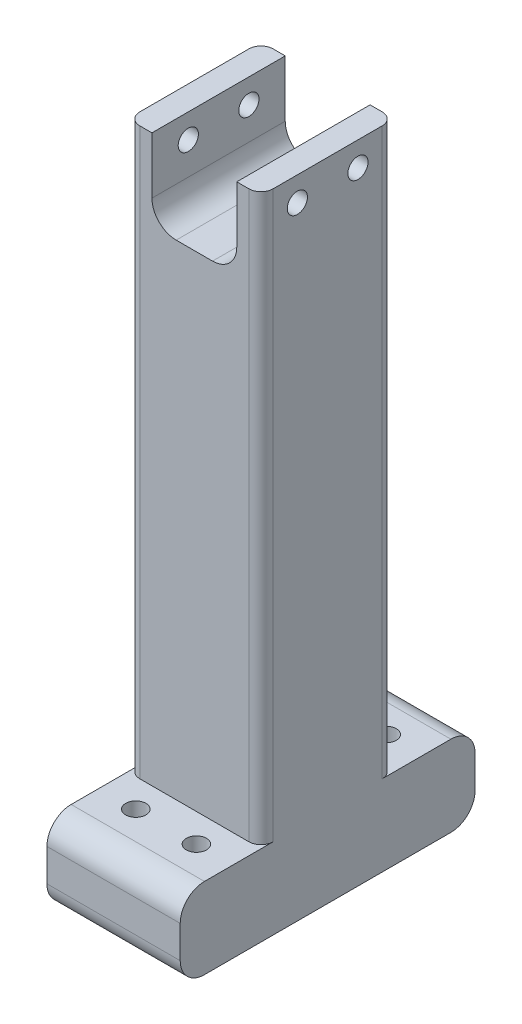
ISO-10303-21;
HEADER;
FILE_DESCRIPTION(('STEP AP214'),'2;1');
FILE_NAME('part.step','',(''),(''),'','','');
FILE_SCHEMA(('AUTOMOTIVE_DESIGN { 1 0 10303 214 1 1 1 1 }'));
ENDSEC;
DATA;
#1=APPLICATION_CONTEXT('core data for automotive mechanical design processes');
#2=APPLICATION_PROTOCOL_DEFINITION('international standard','automotive_design',2000,#1);
#3=PRODUCT_CONTEXT('',#1,'mechanical');
#4=PRODUCT('Part','Part','',(#3));
#5=PRODUCT_RELATED_PRODUCT_CATEGORY('part','',(#4));
#6=PRODUCT_DEFINITION_FORMATION('','',#4);
#7=PRODUCT_DEFINITION_CONTEXT('part definition',#1,'design');
#8=PRODUCT_DEFINITION('design','',#6,#7);
#9=PRODUCT_DEFINITION_SHAPE('','',#8);
#10=(LENGTH_UNIT() NAMED_UNIT(*) SI_UNIT(.MILLI.,.METRE.));
#11=(NAMED_UNIT(*) PLANE_ANGLE_UNIT() SI_UNIT($,.RADIAN.));
#12=(NAMED_UNIT(*) SI_UNIT($,.STERADIAN.) SOLID_ANGLE_UNIT());
#13=UNCERTAINTY_MEASURE_WITH_UNIT(LENGTH_MEASURE(1.E-05),#10,'distance_accuracy_value','');
#14=(GEOMETRIC_REPRESENTATION_CONTEXT(3) GLOBAL_UNCERTAINTY_ASSIGNED_CONTEXT((#13)) GLOBAL_UNIT_ASSIGNED_CONTEXT((#10,
#11,#12)) REPRESENTATION_CONTEXT('',''));
#15=CARTESIAN_POINT('',(0.,0.,0.));
#16=DIRECTION('',(0.,0.,1.));
#17=DIRECTION('',(1.,0.,0.));
#18=AXIS2_PLACEMENT_3D('',#15,#16,#17);
#19=CARTESIAN_POINT('',(-20.955,203.2,-20.955));
#20=DIRECTION('',(0.,0.,-1.));
#21=DIRECTION('',(-1.,0.,0.));
#22=AXIS2_PLACEMENT_3D('',#19,#20,#21);
#23=PLANE('',#22);
#24=DIRECTION('',(1.,0.,0.));
#25=VECTOR('',#24,1.);
#26=CARTESIAN_POINT('',(-20.955,203.2,-20.955));
#27=LINE('',#26,#25);
#28=CARTESIAN_POINT('',(13.335,203.2,-20.955));
#29=VERTEX_POINT('',#28);
#30=CARTESIAN_POINT('',(17.145,203.2,-20.955));
#31=VERTEX_POINT('',#30);
#32=EDGE_CURVE('E242',#29,#31,#27,.T.);
#33=ORIENTED_EDGE('',*,*,#32,.T.);
#34=DIRECTION('',(0.,-1.,0.));
#35=VECTOR('',#34,1.);
#36=CARTESIAN_POINT('',(17.145,203.2,-20.955));
#37=LINE('',#36,#35);
#38=CARTESIAN_POINT('',(17.145,25.4,-20.955));
#39=VERTEX_POINT('',#38);
#40=EDGE_CURVE('E265',#31,#39,#37,.T.);
#41=ORIENTED_EDGE('',*,*,#40,.T.);
#42=DIRECTION('',(-1.,0.,0.));
#43=VECTOR('',#42,1.);
#44=CARTESIAN_POINT('',(-20.955,25.4,-20.955));
#45=LINE('',#44,#43);
#46=CARTESIAN_POINT('',(-17.145,25.4,-20.955));
#47=VERTEX_POINT('',#46);
#48=EDGE_CURVE('E450',#39,#47,#45,.T.);
#49=ORIENTED_EDGE('',*,*,#48,.T.);
#50=DIRECTION('',(0.,-1.,0.));
#51=VECTOR('',#50,1.);
#52=CARTESIAN_POINT('',(-17.145,203.2,-20.955));
#53=LINE('',#52,#51);
#54=CARTESIAN_POINT('',(-17.145,203.2,-20.955));
#55=VERTEX_POINT('',#54);
#56=EDGE_CURVE('E251',#47,#55,#53,.F.);
#57=ORIENTED_EDGE('',*,*,#56,.T.);
#58=CARTESIAN_POINT('',(-13.335,203.2,-20.955));
#59=VERTEX_POINT('',#58);
#60=EDGE_CURVE('E239',#55,#59,#27,.T.);
#61=ORIENTED_EDGE('',*,*,#60,.T.);
#62=DIRECTION('',(0.,-1.,0.));
#63=VECTOR('',#62,1.);
#64=CARTESIAN_POINT('',(-13.335,185.42,-20.955));
#65=LINE('',#64,#63);
#66=CARTESIAN_POINT('',(-13.335,185.42,-20.955));
#67=VERTEX_POINT('',#66);
#68=EDGE_CURVE('E194',#59,#67,#65,.T.);
#69=ORIENTED_EDGE('',*,*,#68,.T.);
#70=CARTESIAN_POINT('',(-5.715,185.42,-20.955));
#71=DIRECTION('',(0.,0.,1.));
#72=DIRECTION('',(1.,0.,0.));
#73=AXIS2_PLACEMENT_3D('',#70,#71,#72);
#74=CIRCLE('',#73,7.61999999999999);
#75=CARTESIAN_POINT('',(-5.715,177.8,-20.955));
#76=VERTEX_POINT('',#75);
#77=EDGE_CURVE('E186',#67,#76,#74,.T.);
#78=ORIENTED_EDGE('',*,*,#77,.T.);
#79=DIRECTION('',(1.,0.,0.));
#80=VECTOR('',#79,1.);
#81=CARTESIAN_POINT('',(5.715,177.8,-20.955));
#82=LINE('',#81,#80);
#83=CARTESIAN_POINT('',(5.715,177.8,-20.955));
#84=VERTEX_POINT('',#83);
#85=EDGE_CURVE('E197',#76,#84,#82,.T.);
#86=ORIENTED_EDGE('',*,*,#85,.T.);
#87=CARTESIAN_POINT('',(5.715,185.42,-20.955));
#88=DIRECTION('',(0.,0.,1.));
#89=DIRECTION('',(-1.,0.,0.));
#90=AXIS2_PLACEMENT_3D('',#87,#88,#89);
#91=CIRCLE('',#90,7.61999999999999);
#92=CARTESIAN_POINT('',(13.335,185.42,-20.955));
#93=VERTEX_POINT('',#92);
#94=EDGE_CURVE('E202',#84,#93,#91,.T.);
#95=ORIENTED_EDGE('',*,*,#94,.T.);
#96=DIRECTION('',(0.,1.,0.));
#97=VECTOR('',#96,1.);
#98=CARTESIAN_POINT('',(13.335,203.2,-20.955));
#99=LINE('',#98,#97);
#100=EDGE_CURVE('E216',#93,#29,#99,.T.);
#101=ORIENTED_EDGE('',*,*,#100,.T.);
#102=EDGE_LOOP('',(#33,#41,#49,#57,#61,#69,#78,#86,#95,#101));
#103=FACE_BOUND('',#102,.T.);
#104=ADVANCED_FACE('F32',(#103),#23,.T.);
#105=CARTESIAN_POINT('',(0.,203.2,0.));
#106=DIRECTION('',(0.,-1.,0.));
#107=DIRECTION('',(0.,0.,-1.));
#108=AXIS2_PLACEMENT_3D('',#105,#106,#107);
#109=PLANE('',#108);
#110=ORIENTED_EDGE('',*,*,#60,.F.);
#111=CARTESIAN_POINT('',(-17.145,203.2,-17.145));
#112=DIRECTION('',(0.,-1.,0.));
#113=DIRECTION('',(0.,0.,-1.));
#114=AXIS2_PLACEMENT_3D('',#111,#112,#113);
#115=CIRCLE('',#114,3.81);
#116=CARTESIAN_POINT('',(-20.955,203.2,-17.145));
#117=VERTEX_POINT('',#116);
#118=EDGE_CURVE('E289',#55,#117,#115,.F.);
#119=ORIENTED_EDGE('',*,*,#118,.T.);
#120=DIRECTION('',(0.,0.,-1.));
#121=VECTOR('',#120,1.);
#122=CARTESIAN_POINT('',(-20.955,203.2,-20.955));
#123=LINE('',#122,#121);
#124=CARTESIAN_POINT('',(-20.955,203.2,17.145));
#125=VERTEX_POINT('',#124);
#126=EDGE_CURVE('E248',#125,#117,#123,.T.);
#127=ORIENTED_EDGE('',*,*,#126,.F.);
#128=CARTESIAN_POINT('',(-17.145,203.2,17.145));
#129=DIRECTION('',(0.,-1.,0.));
#130=DIRECTION('',(0.,0.,-1.));
#131=AXIS2_PLACEMENT_3D('',#128,#129,#130);
#132=CIRCLE('',#131,3.81);
#133=CARTESIAN_POINT('',(-17.145,203.2,20.955));
#134=VERTEX_POINT('',#133);
#135=EDGE_CURVE('E287',#125,#134,#132,.F.);
#136=ORIENTED_EDGE('',*,*,#135,.T.);
#137=DIRECTION('',(-1.,0.,0.));
#138=VECTOR('',#137,1.);
#139=CARTESIAN_POINT('',(-20.955,203.2,20.955));
#140=LINE('',#139,#138);
#141=CARTESIAN_POINT('',(-13.335,203.2,20.955));
#142=VERTEX_POINT('',#141);
#143=EDGE_CURVE('E245',#142,#134,#140,.T.);
#144=ORIENTED_EDGE('',*,*,#143,.F.);
#145=DIRECTION('',(0.,0.,1.));
#146=VECTOR('',#145,1.);
#147=CARTESIAN_POINT('',(-13.335,203.2,-20.955));
#148=LINE('',#147,#146);
#149=EDGE_CURVE('E231',#59,#142,#148,.T.);
#150=ORIENTED_EDGE('',*,*,#149,.F.);
#151=EDGE_LOOP('',(#110,#119,#127,#136,#144,#150));
#152=FACE_BOUND('',#151,.T.);
#153=ADVANCED_FACE('F391',(#152),#109,.F.);
#154=CARTESIAN_POINT('',(-20.955,203.2,-20.955));
#155=DIRECTION('',(-1.,0.,0.));
#156=DIRECTION('',(0.,0.,1.));
#157=AXIS2_PLACEMENT_3D('',#154,#155,#156);
#158=PLANE('',#157);
#159=CARTESIAN_POINT('',(-20.955,195.58,-9.525));
#160=DIRECTION('',(-1.,0.,0.));
#161=DIRECTION('',(0.,0.,1.));
#162=AXIS2_PLACEMENT_3D('',#159,#160,#161);
#163=CIRCLE('',#162,3.175);
#164=CARTESIAN_POINT('',(-20.955,195.58,-6.35));
#165=VERTEX_POINT('',#164);
#166=EDGE_CURVE('E359',#165,#165,#163,.T.);
#167=ORIENTED_EDGE('',*,*,#166,.F.);
#168=EDGE_LOOP('',(#167));
#169=FACE_BOUND('',#168,.T.);
#170=CARTESIAN_POINT('',(-20.955,195.58,9.525));
#171=DIRECTION('',(-1.,0.,0.));
#172=DIRECTION('',(0.,0.,1.));
#173=AXIS2_PLACEMENT_3D('',#170,#171,#172);
#174=CIRCLE('',#173,3.175);
#175=CARTESIAN_POINT('',(-20.955,195.58,12.7));
#176=VERTEX_POINT('',#175);
#177=EDGE_CURVE('E356',#176,#176,#174,.T.);
#178=ORIENTED_EDGE('',*,*,#177,.F.);
#179=EDGE_LOOP('',(#178));
#180=FACE_BOUND('',#179,.T.);
#181=DIRECTION('',(0.,0.,1.));
#182=VECTOR('',#181,1.);
#183=CARTESIAN_POINT('',(-20.955,25.4,-46.355));
#184=LINE('',#183,#182);
#185=CARTESIAN_POINT('',(-20.955,25.4,-38.735));
#186=VERTEX_POINT('',#185);
#187=CARTESIAN_POINT('',(-20.955,25.4,-17.145));
#188=VERTEX_POINT('',#187);
#189=EDGE_CURVE('E462',#186,#188,#184,.T.);
#190=ORIENTED_EDGE('',*,*,#189,.F.);
#191=CARTESIAN_POINT('',(-20.955,17.78,-38.735));
#192=DIRECTION('',(-1.,0.,0.));
#193=DIRECTION('',(0.,0.,1.));
#194=AXIS2_PLACEMENT_3D('',#191,#192,#193);
#195=CIRCLE('',#194,7.62);
#196=CARTESIAN_POINT('',(-20.955,17.78,-46.355));
#197=VERTEX_POINT('',#196);
#198=EDGE_CURVE('E310',#186,#197,#195,.T.);
#199=ORIENTED_EDGE('',*,*,#198,.T.);
#200=DIRECTION('',(0.,-1.,0.));
#201=VECTOR('',#200,1.);
#202=CARTESIAN_POINT('',(-20.955,0.,-46.355));
#203=LINE('',#202,#201);
#204=CARTESIAN_POINT('',(-20.955,7.62,-46.355));
#205=VERTEX_POINT('',#204);
#206=EDGE_CURVE('E447',#197,#205,#203,.T.);
#207=ORIENTED_EDGE('',*,*,#206,.T.);
#208=CARTESIAN_POINT('',(-20.955,7.62,-38.735));
#209=DIRECTION('',(-1.,0.,0.));
#210=DIRECTION('',(0.,0.,1.));
#211=AXIS2_PLACEMENT_3D('',#208,#209,#210);
#212=CIRCLE('',#211,7.62);
#213=CARTESIAN_POINT('',(-20.955,0.,-38.735));
#214=VERTEX_POINT('',#213);
#215=EDGE_CURVE('E308',#205,#214,#212,.T.);
#216=ORIENTED_EDGE('',*,*,#215,.T.);
#217=DIRECTION('',(0.,0.,-1.));
#218=VECTOR('',#217,1.);
#219=CARTESIAN_POINT('',(-20.955,0.,-20.955));
#220=LINE('',#219,#218);
#221=CARTESIAN_POINT('',(-20.955,0.,38.735));
#222=VERTEX_POINT('',#221);
#223=EDGE_CURVE('E253',#222,#214,#220,.T.);
#224=ORIENTED_EDGE('',*,*,#223,.F.);
#225=CARTESIAN_POINT('',(-20.955,7.62,38.735));
#226=DIRECTION('',(-1.,0.,0.));
#227=DIRECTION('',(0.,0.,1.));
#228=AXIS2_PLACEMENT_3D('',#225,#226,#227);
#229=CIRCLE('',#228,7.62);
#230=CARTESIAN_POINT('',(-20.955,7.62,46.355));
#231=VERTEX_POINT('',#230);
#232=EDGE_CURVE('E306',#222,#231,#229,.T.);
#233=ORIENTED_EDGE('',*,*,#232,.T.);
#234=DIRECTION('',(0.,-1.,0.));
#235=VECTOR('',#234,1.);
#236=CARTESIAN_POINT('',(-20.955,0.,46.355));
#237=LINE('',#236,#235);
#238=CARTESIAN_POINT('',(-20.955,17.78,46.355));
#239=VERTEX_POINT('',#238);
#240=EDGE_CURVE('E337',#239,#231,#237,.T.);
#241=ORIENTED_EDGE('',*,*,#240,.F.);
#242=CARTESIAN_POINT('',(-20.955,17.78,38.735));
#243=DIRECTION('',(-1.,0.,0.));
#244=DIRECTION('',(0.,0.,1.));
#245=AXIS2_PLACEMENT_3D('',#242,#243,#244);
#246=CIRCLE('',#245,7.62);
#247=CARTESIAN_POINT('',(-20.955,25.4,38.735));
#248=VERTEX_POINT('',#247);
#249=EDGE_CURVE('E304',#239,#248,#246,.T.);
#250=ORIENTED_EDGE('',*,*,#249,.T.);
#251=DIRECTION('',(0.,0.,-1.));
#252=VECTOR('',#251,1.);
#253=CARTESIAN_POINT('',(-20.955,25.4,46.355));
#254=LINE('',#253,#252);
#255=CARTESIAN_POINT('',(-20.955,25.4,17.145));
#256=VERTEX_POINT('',#255);
#257=EDGE_CURVE('E344',#248,#256,#254,.T.);
#258=ORIENTED_EDGE('',*,*,#257,.T.);
#259=DIRECTION('',(0.,-1.,0.));
#260=VECTOR('',#259,1.);
#261=CARTESIAN_POINT('',(-20.955,203.2,17.145));
#262=LINE('',#261,#260);
#263=EDGE_CURVE('E282',#256,#125,#262,.F.);
#264=ORIENTED_EDGE('',*,*,#263,.T.);
#265=ORIENTED_EDGE('',*,*,#126,.T.);
#266=DIRECTION('',(0.,-1.,0.));
#267=VECTOR('',#266,1.);
#268=CARTESIAN_POINT('',(-20.955,203.2,-17.145));
#269=LINE('',#268,#267);
#270=EDGE_CURVE('E284',#117,#188,#269,.T.);
#271=ORIENTED_EDGE('',*,*,#270,.T.);
#272=EDGE_LOOP('',(#190,#199,#207,#216,#224,#233,#241,#250,#258,#264,#265,#271));
#273=FACE_BOUND('',#272,.T.);
#274=ADVANCED_FACE('F396',(#169,#180,#273),#158,.T.);
#275=CARTESIAN_POINT('',(-20.955,203.2,20.955));
#276=DIRECTION('',(0.,0.,1.));
#277=DIRECTION('',(1.,0.,0.));
#278=AXIS2_PLACEMENT_3D('',#275,#276,#277);
#279=PLANE('',#278);
#280=DIRECTION('',(-1.,0.,0.));
#281=VECTOR('',#280,1.);
#282=CARTESIAN_POINT('',(-20.955,25.4,20.955));
#283=LINE('',#282,#281);
#284=CARTESIAN_POINT('',(17.145,25.4,20.955));
#285=VERTEX_POINT('',#284);
#286=CARTESIAN_POINT('',(-17.145,25.4,20.955));
#287=VERTEX_POINT('',#286);
#288=EDGE_CURVE('E348',#285,#287,#283,.T.);
#289=ORIENTED_EDGE('',*,*,#288,.F.);
#290=DIRECTION('',(0.,-1.,0.));
#291=VECTOR('',#290,1.);
#292=CARTESIAN_POINT('',(17.145,203.2,20.955));
#293=LINE('',#292,#291);
#294=CARTESIAN_POINT('',(17.145,203.2,20.955));
#295=VERTEX_POINT('',#294);
#296=EDGE_CURVE('E280',#285,#295,#293,.F.);
#297=ORIENTED_EDGE('',*,*,#296,.T.);
#298=CARTESIAN_POINT('',(13.335,203.2,20.955));
#299=VERTEX_POINT('',#298);
#300=EDGE_CURVE('E246',#295,#299,#140,.T.);
#301=ORIENTED_EDGE('',*,*,#300,.T.);
#302=DIRECTION('',(0.,1.,0.));
#303=VECTOR('',#302,1.);
#304=CARTESIAN_POINT('',(13.335,203.2,20.955));
#305=LINE('',#304,#303);
#306=CARTESIAN_POINT('',(13.335,185.42,20.955));
#307=VERTEX_POINT('',#306);
#308=EDGE_CURVE('E209',#307,#299,#305,.T.);
#309=ORIENTED_EDGE('',*,*,#308,.F.);
#310=CARTESIAN_POINT('',(5.715,185.42,20.955));
#311=DIRECTION('',(0.,0.,1.));
#312=DIRECTION('',(-1.,0.,0.));
#313=AXIS2_PLACEMENT_3D('',#310,#311,#312);
#314=CIRCLE('',#313,7.61999999999999);
#315=CARTESIAN_POINT('',(5.715,177.8,20.955));
#316=VERTEX_POINT('',#315);
#317=EDGE_CURVE('E223',#316,#307,#314,.T.);
#318=ORIENTED_EDGE('',*,*,#317,.F.);
#319=DIRECTION('',(1.,0.,0.));
#320=VECTOR('',#319,1.);
#321=CARTESIAN_POINT('',(5.715,177.8,20.955));
#322=LINE('',#321,#320);
#323=CARTESIAN_POINT('',(-5.715,177.8,20.955));
#324=VERTEX_POINT('',#323);
#325=EDGE_CURVE('E221',#324,#316,#322,.T.);
#326=ORIENTED_EDGE('',*,*,#325,.F.);
#327=CARTESIAN_POINT('',(-5.715,185.42,20.955));
#328=DIRECTION('',(0.,0.,1.));
#329=DIRECTION('',(1.,0.,0.));
#330=AXIS2_PLACEMENT_3D('',#327,#328,#329);
#331=CIRCLE('',#330,7.61999999999999);
#332=CARTESIAN_POINT('',(-13.335,185.42,20.955));
#333=VERTEX_POINT('',#332);
#334=EDGE_CURVE('E189',#333,#324,#331,.T.);
#335=ORIENTED_EDGE('',*,*,#334,.F.);
#336=DIRECTION('',(0.,-1.,0.));
#337=VECTOR('',#336,1.);
#338=CARTESIAN_POINT('',(-13.335,185.42,20.955));
#339=LINE('',#338,#337);
#340=EDGE_CURVE('E206',#142,#333,#339,.T.);
#341=ORIENTED_EDGE('',*,*,#340,.F.);
#342=ORIENTED_EDGE('',*,*,#143,.T.);
#343=DIRECTION('',(0.,-1.,0.));
#344=VECTOR('',#343,1.);
#345=CARTESIAN_POINT('',(-17.145,203.2,20.955));
#346=LINE('',#345,#344);
#347=EDGE_CURVE('E277',#134,#287,#346,.T.);
#348=ORIENTED_EDGE('',*,*,#347,.T.);
#349=EDGE_LOOP('',(#289,#297,#301,#309,#318,#326,#335,#341,#342,#348));
#350=FACE_BOUND('',#349,.T.);
#351=ADVANCED_FACE('F494',(#350),#279,.T.);
#352=CARTESIAN_POINT('',(20.955,203.2,-20.955));
#353=DIRECTION('',(1.,0.,0.));
#354=DIRECTION('',(0.,0.,-1.));
#355=AXIS2_PLACEMENT_3D('',#352,#353,#354);
#356=PLANE('',#355);
#357=CARTESIAN_POINT('',(20.955,195.58,-9.525));
#358=DIRECTION('',(-1.,0.,0.));
#359=DIRECTION('',(0.,0.,1.));
#360=AXIS2_PLACEMENT_3D('',#357,#358,#359);
#361=CIRCLE('',#360,3.175);
#362=CARTESIAN_POINT('',(20.955,195.58,-6.35));
#363=VERTEX_POINT('',#362);
#364=EDGE_CURVE('E260',#363,#363,#361,.T.);
#365=ORIENTED_EDGE('',*,*,#364,.T.);
#366=EDGE_LOOP('',(#365));
#367=FACE_BOUND('',#366,.T.);
#368=CARTESIAN_POINT('',(20.955,195.58,9.525));
#369=DIRECTION('',(-1.,0.,0.));
#370=DIRECTION('',(0.,0.,1.));
#371=AXIS2_PLACEMENT_3D('',#368,#369,#370);
#372=CIRCLE('',#371,3.175);
#373=CARTESIAN_POINT('',(20.955,195.58,12.7));
#374=VERTEX_POINT('',#373);
#375=EDGE_CURVE('E362',#374,#374,#372,.T.);
#376=ORIENTED_EDGE('',*,*,#375,.T.);
#377=EDGE_LOOP('',(#376));
#378=FACE_BOUND('',#377,.T.);
#379=DIRECTION('',(0.,1.,0.));
#380=VECTOR('',#379,1.);
#381=CARTESIAN_POINT('',(20.955,0.,-46.355));
#382=LINE('',#381,#380);
#383=CARTESIAN_POINT('',(20.955,7.62,-46.355));
#384=VERTEX_POINT('',#383);
#385=CARTESIAN_POINT('',(20.955,17.78,-46.355));
#386=VERTEX_POINT('',#385);
#387=EDGE_CURVE('E449',#384,#386,#382,.T.);
#388=ORIENTED_EDGE('',*,*,#387,.T.);
#389=CARTESIAN_POINT('',(20.955,17.78,-38.735));
#390=DIRECTION('',(1.,0.,0.));
#391=DIRECTION('',(0.,0.,-1.));
#392=AXIS2_PLACEMENT_3D('',#389,#390,#391);
#393=CIRCLE('',#392,7.62);
#394=CARTESIAN_POINT('',(20.955,25.4,-38.735));
#395=VERTEX_POINT('',#394);
#396=EDGE_CURVE('E320',#386,#395,#393,.T.);
#397=ORIENTED_EDGE('',*,*,#396,.T.);
#398=DIRECTION('',(0.,0.,1.));
#399=VECTOR('',#398,1.);
#400=CARTESIAN_POINT('',(20.955,25.4,-46.355));
#401=LINE('',#400,#399);
#402=CARTESIAN_POINT('',(20.955,25.4,-17.145));
#403=VERTEX_POINT('',#402);
#404=EDGE_CURVE('E452',#395,#403,#401,.T.);
#405=ORIENTED_EDGE('',*,*,#404,.T.);
#406=DIRECTION('',(0.,-1.,0.));
#407=VECTOR('',#406,1.);
#408=CARTESIAN_POINT('',(20.955,203.2,-17.145));
#409=LINE('',#408,#407);
#410=CARTESIAN_POINT('',(20.955,203.2,-17.145));
#411=VERTEX_POINT('',#410);
#412=EDGE_CURVE('E271',#403,#411,#409,.F.);
#413=ORIENTED_EDGE('',*,*,#412,.T.);
#414=DIRECTION('',(0.,0.,1.));
#415=VECTOR('',#414,1.);
#416=CARTESIAN_POINT('',(20.955,203.2,-20.955));
#417=LINE('',#416,#415);
#418=CARTESIAN_POINT('',(20.955,203.2,17.145));
#419=VERTEX_POINT('',#418);
#420=EDGE_CURVE('E241',#411,#419,#417,.T.);
#421=ORIENTED_EDGE('',*,*,#420,.T.);
#422=DIRECTION('',(0.,-1.,0.));
#423=VECTOR('',#422,1.);
#424=CARTESIAN_POINT('',(20.955,203.2,17.145));
#425=LINE('',#424,#423);
#426=CARTESIAN_POINT('',(20.955,25.4,17.145));
#427=VERTEX_POINT('',#426);
#428=EDGE_CURVE('E268',#419,#427,#425,.T.);
#429=ORIENTED_EDGE('',*,*,#428,.T.);
#430=DIRECTION('',(0.,0.,-1.));
#431=VECTOR('',#430,1.);
#432=CARTESIAN_POINT('',(20.955,25.4,46.355));
#433=LINE('',#432,#431);
#434=CARTESIAN_POINT('',(20.955,25.4,38.735));
#435=VERTEX_POINT('',#434);
#436=EDGE_CURVE('E346',#435,#427,#433,.T.);
#437=ORIENTED_EDGE('',*,*,#436,.F.);
#438=CARTESIAN_POINT('',(20.955,17.78,38.735));
#439=DIRECTION('',(1.,0.,0.));
#440=DIRECTION('',(0.,0.,-1.));
#441=AXIS2_PLACEMENT_3D('',#438,#439,#440);
#442=CIRCLE('',#441,7.62);
#443=CARTESIAN_POINT('',(20.955,17.78,46.355));
#444=VERTEX_POINT('',#443);
#445=EDGE_CURVE('E316',#435,#444,#442,.T.);
#446=ORIENTED_EDGE('',*,*,#445,.T.);
#447=DIRECTION('',(0.,1.,0.));
#448=VECTOR('',#447,1.);
#449=CARTESIAN_POINT('',(20.955,0.,46.355));
#450=LINE('',#449,#448);
#451=CARTESIAN_POINT('',(20.955,7.62,46.355));
#452=VERTEX_POINT('',#451);
#453=EDGE_CURVE('E334',#452,#444,#450,.T.);
#454=ORIENTED_EDGE('',*,*,#453,.F.);
#455=CARTESIAN_POINT('',(20.955,7.62,38.735));
#456=DIRECTION('',(1.,0.,0.));
#457=DIRECTION('',(0.,0.,-1.));
#458=AXIS2_PLACEMENT_3D('',#455,#456,#457);
#459=CIRCLE('',#458,7.62);
#460=CARTESIAN_POINT('',(20.955,0.,38.735));
#461=VERTEX_POINT('',#460);
#462=EDGE_CURVE('E47',#452,#461,#459,.T.);
#463=ORIENTED_EDGE('',*,*,#462,.T.);
#464=DIRECTION('',(0.,0.,1.));
#465=VECTOR('',#464,1.);
#466=CARTESIAN_POINT('',(20.955,0.,-20.955));
#467=LINE('',#466,#465);
#468=CARTESIAN_POINT('',(20.955,0.,-38.735));
#469=VERTEX_POINT('',#468);
#470=EDGE_CURVE('E230',#469,#461,#467,.T.);
#471=ORIENTED_EDGE('',*,*,#470,.F.);
#472=CARTESIAN_POINT('',(20.955,7.62,-38.735));
#473=DIRECTION('',(1.,0.,0.));
#474=DIRECTION('',(0.,0.,-1.));
#475=AXIS2_PLACEMENT_3D('',#472,#473,#474);
#476=CIRCLE('',#475,7.62);
#477=EDGE_CURVE('E55',#469,#384,#476,.T.);
#478=ORIENTED_EDGE('',*,*,#477,.T.);
#479=EDGE_LOOP('',(#388,#397,#405,#413,#421,#429,#437,#446,#454,#463,#471,#478));
#480=FACE_BOUND('',#479,.T.);
#481=ADVANCED_FACE('F341',(#367,#378,#480),#356,.T.);
#482=ORIENTED_EDGE('',*,*,#420,.F.);
#483=CARTESIAN_POINT('',(17.145,203.2,-17.145));
#484=DIRECTION('',(0.,-1.,0.));
#485=DIRECTION('',(0.,0.,-1.));
#486=AXIS2_PLACEMENT_3D('',#483,#484,#485);
#487=CIRCLE('',#486,3.81);
#488=EDGE_CURVE('E275',#411,#31,#487,.F.);
#489=ORIENTED_EDGE('',*,*,#488,.T.);
#490=ORIENTED_EDGE('',*,*,#32,.F.);
#491=DIRECTION('',(0.,0.,1.));
#492=VECTOR('',#491,1.);
#493=CARTESIAN_POINT('',(13.335,203.2,-20.955));
#494=LINE('',#493,#492);
#495=EDGE_CURVE('E233',#29,#299,#494,.T.);
#496=ORIENTED_EDGE('',*,*,#495,.T.);
#497=ORIENTED_EDGE('',*,*,#300,.F.);
#498=CARTESIAN_POINT('',(17.145,203.2,17.145));
#499=DIRECTION('',(0.,-1.,0.));
#500=DIRECTION('',(0.,0.,-1.));
#501=AXIS2_PLACEMENT_3D('',#498,#499,#500);
#502=CIRCLE('',#501,3.81);
#503=EDGE_CURVE('E273',#295,#419,#502,.F.);
#504=ORIENTED_EDGE('',*,*,#503,.T.);
#505=EDGE_LOOP('',(#482,#489,#490,#496,#497,#504));
#506=FACE_BOUND('',#505,.T.);
#507=ADVANCED_FACE('F399',(#506),#109,.F.);
#508=CARTESIAN_POINT('',(0.,0.,0.));
#509=DIRECTION('',(0.,-1.,0.));
#510=DIRECTION('',(0.,0.,-1.));
#511=AXIS2_PLACEMENT_3D('',#508,#509,#510);
#512=PLANE('',#511);
#513=CARTESIAN_POINT('',(-9.525,0.,-29.845));
#514=DIRECTION('',(0.,-1.,0.));
#515=DIRECTION('',(-1.,0.,0.));
#516=AXIS2_PLACEMENT_3D('',#513,#514,#515);
#517=CIRCLE('',#516,3.175);
#518=CARTESIAN_POINT('',(-12.7,0.,-29.845));
#519=VERTEX_POINT('',#518);
#520=EDGE_CURVE('E455',#519,#519,#517,.T.);
#521=ORIENTED_EDGE('',*,*,#520,.F.);
#522=EDGE_LOOP('',(#521));
#523=FACE_BOUND('',#522,.T.);
#524=CARTESIAN_POINT('',(9.525,0.,-29.845));
#525=DIRECTION('',(0.,-1.,0.));
#526=DIRECTION('',(-1.,0.,0.));
#527=AXIS2_PLACEMENT_3D('',#524,#525,#526);
#528=CIRCLE('',#527,3.175);
#529=CARTESIAN_POINT('',(6.35,0.,-29.845));
#530=VERTEX_POINT('',#529);
#531=EDGE_CURVE('E772',#530,#530,#528,.T.);
#532=ORIENTED_EDGE('',*,*,#531,.F.);
#533=EDGE_LOOP('',(#532));
#534=FACE_BOUND('',#533,.T.);
#535=CARTESIAN_POINT('',(-9.525,0.,29.845));
#536=DIRECTION('',(0.,1.,0.));
#537=DIRECTION('',(-1.,0.,0.));
#538=AXIS2_PLACEMENT_3D('',#535,#536,#537);
#539=CIRCLE('',#538,3.175);
#540=CARTESIAN_POINT('',(-12.7,0.,29.845));
#541=VERTEX_POINT('',#540);
#542=EDGE_CURVE('E353',#541,#541,#539,.T.);
#543=ORIENTED_EDGE('',*,*,#542,.T.);
#544=EDGE_LOOP('',(#543));
#545=FACE_BOUND('',#544,.T.);
#546=CARTESIAN_POINT('',(9.525,0.,29.845));
#547=DIRECTION('',(0.,1.,0.));
#548=DIRECTION('',(-1.,0.,0.));
#549=AXIS2_PLACEMENT_3D('',#546,#547,#548);
#550=CIRCLE('',#549,3.175);
#551=CARTESIAN_POINT('',(6.35,0.,29.845));
#552=VERTEX_POINT('',#551);
#553=EDGE_CURVE('E470',#552,#552,#550,.T.);
#554=ORIENTED_EDGE('',*,*,#553,.T.);
#555=EDGE_LOOP('',(#554));
#556=FACE_BOUND('',#555,.T.);
#557=ORIENTED_EDGE('',*,*,#223,.T.);
#558=DIRECTION('',(1.,0.,0.));
#559=VECTOR('',#558,1.);
#560=CARTESIAN_POINT('',(20.955,0.,-38.735));
#561=LINE('',#560,#559);
#562=EDGE_CURVE('E324',#214,#469,#561,.T.);
#563=ORIENTED_EDGE('',*,*,#562,.T.);
#564=ORIENTED_EDGE('',*,*,#470,.T.);
#565=DIRECTION('',(1.,0.,0.));
#566=VECTOR('',#565,1.);
#567=CARTESIAN_POINT('',(-20.955,0.,38.735));
#568=LINE('',#567,#566);
#569=EDGE_CURVE('E322',#461,#222,#568,.F.);
#570=ORIENTED_EDGE('',*,*,#569,.T.);
#571=EDGE_LOOP('',(#557,#563,#564,#570));
#572=FACE_BOUND('',#571,.T.);
#573=ADVANCED_FACE('F403',(#523,#534,#545,#556,#572),#512,.T.);
#574=CARTESIAN_POINT('',(-5.715,185.42,-20.955));
#575=DIRECTION('',(0.,0.,1.));
#576=DIRECTION('',(1.,0.,0.));
#577=AXIS2_PLACEMENT_3D('',#574,#575,#576);
#578=CYLINDRICAL_SURFACE('',#577,7.61999999999999);
#579=ORIENTED_EDGE('',*,*,#334,.T.);
#580=DIRECTION('',(0.,0.,1.));
#581=VECTOR('',#580,1.);
#582=CARTESIAN_POINT('',(-5.715,177.8,-20.955));
#583=LINE('',#582,#581);
#584=EDGE_CURVE('E182',#76,#324,#583,.T.);
#585=ORIENTED_EDGE('',*,*,#584,.F.);
#586=ORIENTED_EDGE('',*,*,#77,.F.);
#587=DIRECTION('',(0.,0.,1.));
#588=VECTOR('',#587,1.);
#589=CARTESIAN_POINT('',(-13.335,185.42,-20.955));
#590=LINE('',#589,#588);
#591=EDGE_CURVE('E228',#67,#333,#590,.T.);
#592=ORIENTED_EDGE('',*,*,#591,.T.);
#593=EDGE_LOOP('',(#579,#585,#586,#592));
#594=FACE_BOUND('',#593,.T.);
#595=ADVANCED_FACE('F184',(#594),#578,.F.);
#596=CARTESIAN_POINT('',(-13.335,185.42,-20.955));
#597=DIRECTION('',(-1.,0.,0.));
#598=DIRECTION('',(0.,0.,1.));
#599=AXIS2_PLACEMENT_3D('',#596,#597,#598);
#600=PLANE('',#599);
#601=CARTESIAN_POINT('',(-13.335,195.58,-9.525));
#602=DIRECTION('',(-1.,0.,0.));
#603=DIRECTION('',(0.,0.,1.));
#604=AXIS2_PLACEMENT_3D('',#601,#602,#603);
#605=CIRCLE('',#604,3.175);
#606=CARTESIAN_POINT('',(-13.335,195.58,-6.35));
#607=VERTEX_POINT('',#606);
#608=EDGE_CURVE('E212',#607,#607,#605,.T.);
#609=ORIENTED_EDGE('',*,*,#608,.T.);
#610=EDGE_LOOP('',(#609));
#611=FACE_BOUND('',#610,.T.);
#612=CARTESIAN_POINT('',(-13.335,195.58,9.525));
#613=DIRECTION('',(-1.,0.,0.));
#614=DIRECTION('',(0.,0.,1.));
#615=AXIS2_PLACEMENT_3D('',#612,#613,#614);
#616=CIRCLE('',#615,3.175);
#617=CARTESIAN_POINT('',(-13.335,195.58,12.7));
#618=VERTEX_POINT('',#617);
#619=EDGE_CURVE('E259',#618,#618,#616,.T.);
#620=ORIENTED_EDGE('',*,*,#619,.T.);
#621=EDGE_LOOP('',(#620));
#622=FACE_BOUND('',#621,.T.);
#623=ORIENTED_EDGE('',*,*,#340,.T.);
#624=ORIENTED_EDGE('',*,*,#591,.F.);
#625=ORIENTED_EDGE('',*,*,#68,.F.);
#626=ORIENTED_EDGE('',*,*,#149,.T.);
#627=EDGE_LOOP('',(#623,#624,#625,#626));
#628=FACE_BOUND('',#627,.T.);
#629=ADVANCED_FACE('F369',(#611,#622,#628),#600,.F.);
#630=CARTESIAN_POINT('',(13.335,203.2,-20.955));
#631=DIRECTION('',(1.,0.,0.));
#632=DIRECTION('',(0.,0.,-1.));
#633=AXIS2_PLACEMENT_3D('',#630,#631,#632);
#634=PLANE('',#633);
#635=CARTESIAN_POINT('',(13.335,195.58,-9.525));
#636=DIRECTION('',(1.,0.,0.));
#637=DIRECTION('',(0.,0.,-1.));
#638=AXIS2_PLACEMENT_3D('',#635,#636,#637);
#639=CIRCLE('',#638,3.175);
#640=CARTESIAN_POINT('',(13.335,195.58,-12.7));
#641=VERTEX_POINT('',#640);
#642=EDGE_CURVE('E261',#641,#641,#639,.T.);
#643=ORIENTED_EDGE('',*,*,#642,.T.);
#644=EDGE_LOOP('',(#643));
#645=FACE_BOUND('',#644,.T.);
#646=CARTESIAN_POINT('',(13.335,195.58,9.525));
#647=DIRECTION('',(1.,0.,0.));
#648=DIRECTION('',(0.,0.,-1.));
#649=AXIS2_PLACEMENT_3D('',#646,#647,#648);
#650=CIRCLE('',#649,3.175);
#651=CARTESIAN_POINT('',(13.335,195.58,6.35));
#652=VERTEX_POINT('',#651);
#653=EDGE_CURVE('E256',#652,#652,#650,.T.);
#654=ORIENTED_EDGE('',*,*,#653,.T.);
#655=EDGE_LOOP('',(#654));
#656=FACE_BOUND('',#655,.T.);
#657=ORIENTED_EDGE('',*,*,#308,.T.);
#658=ORIENTED_EDGE('',*,*,#495,.F.);
#659=ORIENTED_EDGE('',*,*,#100,.F.);
#660=DIRECTION('',(0.,0.,1.));
#661=VECTOR('',#660,1.);
#662=CARTESIAN_POINT('',(13.335,185.42,-20.955));
#663=LINE('',#662,#661);
#664=EDGE_CURVE('E236',#93,#307,#663,.T.);
#665=ORIENTED_EDGE('',*,*,#664,.T.);
#666=EDGE_LOOP('',(#657,#658,#659,#665));
#667=FACE_BOUND('',#666,.T.);
#668=ADVANCED_FACE('F520',(#645,#656,#667),#634,.F.);
#669=CARTESIAN_POINT('',(5.715,185.42,-20.955));
#670=DIRECTION('',(0.,0.,1.));
#671=DIRECTION('',(1.,0.,0.));
#672=AXIS2_PLACEMENT_3D('',#669,#670,#671);
#673=CYLINDRICAL_SURFACE('',#672,7.61999999999999);
#674=ORIENTED_EDGE('',*,*,#317,.T.);
#675=ORIENTED_EDGE('',*,*,#664,.F.);
#676=ORIENTED_EDGE('',*,*,#94,.F.);
#677=DIRECTION('',(0.,0.,1.));
#678=VECTOR('',#677,1.);
#679=CARTESIAN_POINT('',(5.715,177.8,-20.955));
#680=LINE('',#679,#678);
#681=EDGE_CURVE('E193',#84,#316,#680,.T.);
#682=ORIENTED_EDGE('',*,*,#681,.T.);
#683=EDGE_LOOP('',(#674,#675,#676,#682));
#684=FACE_BOUND('',#683,.T.);
#685=ADVANCED_FACE('F517',(#684),#673,.F.);
#686=CARTESIAN_POINT('',(5.715,177.8,-20.955));
#687=DIRECTION('',(0.,-1.,0.));
#688=DIRECTION('',(0.,0.,-1.));
#689=AXIS2_PLACEMENT_3D('',#686,#687,#688);
#690=PLANE('',#689);
#691=ORIENTED_EDGE('',*,*,#325,.T.);
#692=ORIENTED_EDGE('',*,*,#681,.F.);
#693=ORIENTED_EDGE('',*,*,#85,.F.);
#694=ORIENTED_EDGE('',*,*,#584,.T.);
#695=EDGE_LOOP('',(#691,#692,#693,#694));
#696=FACE_BOUND('',#695,.T.);
#697=ADVANCED_FACE('F198',(#696),#690,.F.);
#698=CARTESIAN_POINT('',(20.955,195.58,9.525));
#699=DIRECTION('',(-1.,0.,0.));
#700=DIRECTION('',(0.,0.,1.));
#701=AXIS2_PLACEMENT_3D('',#698,#699,#700);
#702=CYLINDRICAL_SURFACE('',#701,3.175);
#703=ORIENTED_EDGE('',*,*,#375,.F.);
#704=EDGE_LOOP('',(#703));
#705=FACE_BOUND('',#704,.T.);
#706=ORIENTED_EDGE('',*,*,#653,.F.);
#707=EDGE_LOOP('',(#706));
#708=FACE_BOUND('',#707,.T.);
#709=ADVANCED_FACE('F378',(#705,#708),#702,.F.);
#710=CARTESIAN_POINT('',(20.955,195.58,-9.525));
#711=DIRECTION('',(-1.,0.,0.));
#712=DIRECTION('',(0.,0.,1.));
#713=AXIS2_PLACEMENT_3D('',#710,#711,#712);
#714=CYLINDRICAL_SURFACE('',#713,3.175);
#715=ORIENTED_EDGE('',*,*,#364,.F.);
#716=EDGE_LOOP('',(#715));
#717=FACE_BOUND('',#716,.T.);
#718=ORIENTED_EDGE('',*,*,#642,.F.);
#719=EDGE_LOOP('',(#718));
#720=FACE_BOUND('',#719,.T.);
#721=ADVANCED_FACE('F375',(#717,#720),#714,.F.);
#722=ORIENTED_EDGE('',*,*,#177,.T.);
#723=EDGE_LOOP('',(#722));
#724=FACE_BOUND('',#723,.T.);
#725=ORIENTED_EDGE('',*,*,#619,.F.);
#726=EDGE_LOOP('',(#725));
#727=FACE_BOUND('',#726,.T.);
#728=ADVANCED_FACE('F372',(#724,#727),#702,.F.);
#729=ORIENTED_EDGE('',*,*,#166,.T.);
#730=EDGE_LOOP('',(#729));
#731=FACE_BOUND('',#730,.T.);
#732=ORIENTED_EDGE('',*,*,#608,.F.);
#733=EDGE_LOOP('',(#732));
#734=FACE_BOUND('',#733,.T.);
#735=ADVANCED_FACE('F374',(#731,#734),#714,.F.);
#736=CARTESIAN_POINT('',(-20.955,25.4,46.355));
#737=DIRECTION('',(0.,-1.,0.));
#738=DIRECTION('',(1.,0.,0.));
#739=AXIS2_PLACEMENT_3D('',#736,#737,#738);
#740=PLANE('',#739);
#741=CARTESIAN_POINT('',(-9.525,25.4,29.845));
#742=DIRECTION('',(0.,1.,0.));
#743=DIRECTION('',(-1.,0.,0.));
#744=AXIS2_PLACEMENT_3D('',#741,#742,#743);
#745=CIRCLE('',#744,3.175);
#746=CARTESIAN_POINT('',(-12.7,25.4,29.845));
#747=VERTEX_POINT('',#746);
#748=EDGE_CURVE('E467',#747,#747,#745,.T.);
#749=ORIENTED_EDGE('',*,*,#748,.F.);
#750=EDGE_LOOP('',(#749));
#751=FACE_BOUND('',#750,.T.);
#752=CARTESIAN_POINT('',(9.525,25.4,29.845));
#753=DIRECTION('',(0.,1.,0.));
#754=DIRECTION('',(-1.,0.,0.));
#755=AXIS2_PLACEMENT_3D('',#752,#753,#754);
#756=CIRCLE('',#755,3.175);
#757=CARTESIAN_POINT('',(6.35,25.4,29.845));
#758=VERTEX_POINT('',#757);
#759=EDGE_CURVE('E464',#758,#758,#756,.T.);
#760=ORIENTED_EDGE('',*,*,#759,.F.);
#761=EDGE_LOOP('',(#760));
#762=FACE_BOUND('',#761,.T.);
#763=ORIENTED_EDGE('',*,*,#257,.F.);
#764=DIRECTION('',(-1.,0.,0.));
#765=VECTOR('',#764,1.);
#766=CARTESIAN_POINT('',(-20.955,25.4,38.735));
#767=LINE('',#766,#765);
#768=EDGE_CURVE('E11',#248,#435,#767,.F.);
#769=ORIENTED_EDGE('',*,*,#768,.T.);
#770=ORIENTED_EDGE('',*,*,#436,.T.);
#771=CARTESIAN_POINT('',(17.145,25.4,17.145));
#772=DIRECTION('',(0.,-1.,0.));
#773=DIRECTION('',(1.,0.,0.));
#774=AXIS2_PLACEMENT_3D('',#771,#772,#773);
#775=CIRCLE('',#774,3.81);
#776=EDGE_CURVE('E294',#427,#285,#775,.T.);
#777=ORIENTED_EDGE('',*,*,#776,.T.);
#778=ORIENTED_EDGE('',*,*,#288,.T.);
#779=CARTESIAN_POINT('',(-17.145,25.4,17.145));
#780=DIRECTION('',(0.,-1.,0.));
#781=DIRECTION('',(1.,0.,0.));
#782=AXIS2_PLACEMENT_3D('',#779,#780,#781);
#783=CIRCLE('',#782,3.81);
#784=EDGE_CURVE('E298',#287,#256,#783,.T.);
#785=ORIENTED_EDGE('',*,*,#784,.T.);
#786=EDGE_LOOP('',(#763,#769,#770,#777,#778,#785));
#787=FACE_BOUND('',#786,.T.);
#788=ADVANCED_FACE('F383',(#751,#762,#787),#740,.F.);
#789=CARTESIAN_POINT('',(0.,0.,46.355));
#790=DIRECTION('',(0.,0.,-1.));
#791=DIRECTION('',(-1.,0.,0.));
#792=AXIS2_PLACEMENT_3D('',#789,#790,#791);
#793=PLANE('',#792);
#794=ORIENTED_EDGE('',*,*,#240,.T.);
#795=DIRECTION('',(1.,0.,0.));
#796=VECTOR('',#795,1.);
#797=CARTESIAN_POINT('',(20.955,7.62,46.355));
#798=LINE('',#797,#796);
#799=EDGE_CURVE('E40',#231,#452,#798,.T.);
#800=ORIENTED_EDGE('',*,*,#799,.T.);
#801=ORIENTED_EDGE('',*,*,#453,.T.);
#802=DIRECTION('',(-1.,0.,0.));
#803=VECTOR('',#802,1.);
#804=CARTESIAN_POINT('',(0.,17.78,46.355));
#805=LINE('',#804,#803);
#806=EDGE_CURVE('E326',#444,#239,#805,.T.);
#807=ORIENTED_EDGE('',*,*,#806,.T.);
#808=EDGE_LOOP('',(#794,#800,#801,#807));
#809=FACE_BOUND('',#808,.T.);
#810=ADVANCED_FACE('F333',(#809),#793,.F.);
#811=CARTESIAN_POINT('',(9.525,0.,29.845));
#812=DIRECTION('',(0.,1.,0.));
#813=DIRECTION('',(-1.,0.,0.));
#814=AXIS2_PLACEMENT_3D('',#811,#812,#813);
#815=CYLINDRICAL_SURFACE('',#814,3.175);
#816=ORIENTED_EDGE('',*,*,#553,.F.);
#817=EDGE_LOOP('',(#816));
#818=FACE_BOUND('',#817,.T.);
#819=ORIENTED_EDGE('',*,*,#759,.T.);
#820=EDGE_LOOP('',(#819));
#821=FACE_BOUND('',#820,.T.);
#822=ADVANCED_FACE('F475',(#818,#821),#815,.F.);
#823=CARTESIAN_POINT('',(-9.525,0.,29.845));
#824=DIRECTION('',(0.,1.,0.));
#825=DIRECTION('',(-1.,0.,0.));
#826=AXIS2_PLACEMENT_3D('',#823,#824,#825);
#827=CYLINDRICAL_SURFACE('',#826,3.175);
#828=ORIENTED_EDGE('',*,*,#542,.F.);
#829=EDGE_LOOP('',(#828));
#830=FACE_BOUND('',#829,.T.);
#831=ORIENTED_EDGE('',*,*,#748,.T.);
#832=EDGE_LOOP('',(#831));
#833=FACE_BOUND('',#832,.T.);
#834=ADVANCED_FACE('F613',(#830,#833),#827,.F.);
#835=CARTESIAN_POINT('',(-20.955,25.4,-46.355));
#836=DIRECTION('',(0.,1.,0.));
#837=DIRECTION('',(-1.,0.,0.));
#838=AXIS2_PLACEMENT_3D('',#835,#836,#837);
#839=PLANE('',#838);
#840=CARTESIAN_POINT('',(-9.525,25.4,-29.845));
#841=DIRECTION('',(0.,-1.,0.));
#842=DIRECTION('',(-1.,0.,0.));
#843=AXIS2_PLACEMENT_3D('',#840,#841,#842);
#844=CIRCLE('',#843,3.175);
#845=CARTESIAN_POINT('',(-12.7,25.4,-29.845));
#846=VERTEX_POINT('',#845);
#847=EDGE_CURVE('E768',#846,#846,#844,.T.);
#848=ORIENTED_EDGE('',*,*,#847,.T.);
#849=EDGE_LOOP('',(#848));
#850=FACE_BOUND('',#849,.T.);
#851=CARTESIAN_POINT('',(9.525,25.4,-29.845));
#852=DIRECTION('',(0.,-1.,0.));
#853=DIRECTION('',(-1.,0.,0.));
#854=AXIS2_PLACEMENT_3D('',#851,#852,#853);
#855=CIRCLE('',#854,3.175);
#856=CARTESIAN_POINT('',(6.35,25.4,-29.845));
#857=VERTEX_POINT('',#856);
#858=EDGE_CURVE('E458',#857,#857,#855,.T.);
#859=ORIENTED_EDGE('',*,*,#858,.T.);
#860=EDGE_LOOP('',(#859));
#861=FACE_BOUND('',#860,.T.);
#862=ORIENTED_EDGE('',*,*,#404,.F.);
#863=DIRECTION('',(-1.,0.,0.));
#864=VECTOR('',#863,1.);
#865=CARTESIAN_POINT('',(-20.955,25.4,-38.735));
#866=LINE('',#865,#864);
#867=EDGE_CURVE('E301',#395,#186,#866,.T.);
#868=ORIENTED_EDGE('',*,*,#867,.T.);
#869=ORIENTED_EDGE('',*,*,#189,.T.);
#870=CARTESIAN_POINT('',(-17.145,25.4,-17.145));
#871=DIRECTION('',(0.,1.,0.));
#872=DIRECTION('',(-1.,0.,0.));
#873=AXIS2_PLACEMENT_3D('',#870,#871,#872);
#874=CIRCLE('',#873,3.81);
#875=EDGE_CURVE('E296',#188,#47,#874,.F.);
#876=ORIENTED_EDGE('',*,*,#875,.T.);
#877=ORIENTED_EDGE('',*,*,#48,.F.);
#878=CARTESIAN_POINT('',(17.145,25.4,-17.145));
#879=DIRECTION('',(0.,1.,0.));
#880=DIRECTION('',(-1.,0.,0.));
#881=AXIS2_PLACEMENT_3D('',#878,#879,#880);
#882=CIRCLE('',#881,3.81);
#883=EDGE_CURVE('E291',#39,#403,#882,.F.);
#884=ORIENTED_EDGE('',*,*,#883,.T.);
#885=EDGE_LOOP('',(#862,#868,#869,#876,#877,#884));
#886=FACE_BOUND('',#885,.T.);
#887=ADVANCED_FACE('F511',(#850,#861,#886),#839,.T.);
#888=CARTESIAN_POINT('',(0.,0.,-46.355));
#889=DIRECTION('',(0.,0.,1.));
#890=DIRECTION('',(-1.,0.,0.));
#891=AXIS2_PLACEMENT_3D('',#888,#889,#890);
#892=PLANE('',#891);
#893=ORIENTED_EDGE('',*,*,#206,.F.);
#894=DIRECTION('',(-1.,0.,0.));
#895=VECTOR('',#894,1.);
#896=CARTESIAN_POINT('',(20.955,17.78,-46.355));
#897=LINE('',#896,#895);
#898=EDGE_CURVE('E314',#197,#386,#897,.F.);
#899=ORIENTED_EDGE('',*,*,#898,.T.);
#900=ORIENTED_EDGE('',*,*,#387,.F.);
#901=DIRECTION('',(1.,0.,0.));
#902=VECTOR('',#901,1.);
#903=CARTESIAN_POINT('',(-20.955,7.62,-46.355));
#904=LINE('',#903,#902);
#905=EDGE_CURVE('E312',#384,#205,#904,.F.);
#906=ORIENTED_EDGE('',*,*,#905,.T.);
#907=EDGE_LOOP('',(#893,#899,#900,#906));
#908=FACE_BOUND('',#907,.T.);
#909=ADVANCED_FACE('F446',(#908),#892,.F.);
#910=CARTESIAN_POINT('',(9.525,0.,-29.845));
#911=DIRECTION('',(0.,1.,0.));
#912=DIRECTION('',(-1.,0.,0.));
#913=AXIS2_PLACEMENT_3D('',#910,#911,#912);
#914=CYLINDRICAL_SURFACE('',#913,3.175);
#915=ORIENTED_EDGE('',*,*,#531,.T.);
#916=EDGE_LOOP('',(#915));
#917=FACE_BOUND('',#916,.T.);
#918=ORIENTED_EDGE('',*,*,#858,.F.);
#919=EDGE_LOOP('',(#918));
#920=FACE_BOUND('',#919,.T.);
#921=ADVANCED_FACE('F632',(#917,#920),#914,.F.);
#922=CARTESIAN_POINT('',(-9.525,0.,-29.845));
#923=DIRECTION('',(0.,1.,0.));
#924=DIRECTION('',(-1.,0.,0.));
#925=AXIS2_PLACEMENT_3D('',#922,#923,#924);
#926=CYLINDRICAL_SURFACE('',#925,3.175);
#927=ORIENTED_EDGE('',*,*,#520,.T.);
#928=EDGE_LOOP('',(#927));
#929=FACE_BOUND('',#928,.T.);
#930=ORIENTED_EDGE('',*,*,#847,.F.);
#931=EDGE_LOOP('',(#930));
#932=FACE_BOUND('',#931,.T.);
#933=ADVANCED_FACE('F411',(#929,#932),#926,.F.);
#934=CARTESIAN_POINT('',(17.145,203.2,-17.145));
#935=DIRECTION('',(0.,-1.,0.));
#936=DIRECTION('',(0.,0.,-1.));
#937=AXIS2_PLACEMENT_3D('',#934,#935,#936);
#938=CYLINDRICAL_SURFACE('',#937,3.81);
#939=ORIENTED_EDGE('',*,*,#488,.F.);
#940=ORIENTED_EDGE('',*,*,#412,.F.);
#941=ORIENTED_EDGE('',*,*,#883,.F.);
#942=ORIENTED_EDGE('',*,*,#40,.F.);
#943=EDGE_LOOP('',(#939,#940,#941,#942));
#944=FACE_BOUND('',#943,.T.);
#945=ADVANCED_FACE('F407',(#944),#938,.T.);
#946=CARTESIAN_POINT('',(17.145,203.2,17.145));
#947=DIRECTION('',(0.,-1.,0.));
#948=DIRECTION('',(0.,0.,-1.));
#949=AXIS2_PLACEMENT_3D('',#946,#947,#948);
#950=CYLINDRICAL_SURFACE('',#949,3.81);
#951=ORIENTED_EDGE('',*,*,#503,.F.);
#952=ORIENTED_EDGE('',*,*,#296,.F.);
#953=ORIENTED_EDGE('',*,*,#776,.F.);
#954=ORIENTED_EDGE('',*,*,#428,.F.);
#955=EDGE_LOOP('',(#951,#952,#953,#954));
#956=FACE_BOUND('',#955,.T.);
#957=ADVANCED_FACE('F410',(#956),#950,.T.);
#958=CARTESIAN_POINT('',(-17.145,203.2,-17.145));
#959=DIRECTION('',(0.,-1.,0.));
#960=DIRECTION('',(0.,0.,-1.));
#961=AXIS2_PLACEMENT_3D('',#958,#959,#960);
#962=CYLINDRICAL_SURFACE('',#961,3.81);
#963=ORIENTED_EDGE('',*,*,#118,.F.);
#964=ORIENTED_EDGE('',*,*,#56,.F.);
#965=ORIENTED_EDGE('',*,*,#875,.F.);
#966=ORIENTED_EDGE('',*,*,#270,.F.);
#967=EDGE_LOOP('',(#963,#964,#965,#966));
#968=FACE_BOUND('',#967,.T.);
#969=ADVANCED_FACE('F415',(#968),#962,.T.);
#970=CARTESIAN_POINT('',(-17.145,203.2,17.145));
#971=DIRECTION('',(0.,-1.,0.));
#972=DIRECTION('',(0.,0.,-1.));
#973=AXIS2_PLACEMENT_3D('',#970,#971,#972);
#974=CYLINDRICAL_SURFACE('',#973,3.81);
#975=ORIENTED_EDGE('',*,*,#135,.F.);
#976=ORIENTED_EDGE('',*,*,#263,.F.);
#977=ORIENTED_EDGE('',*,*,#784,.F.);
#978=ORIENTED_EDGE('',*,*,#347,.F.);
#979=EDGE_LOOP('',(#975,#976,#977,#978));
#980=FACE_BOUND('',#979,.T.);
#981=ADVANCED_FACE('F419',(#980),#974,.T.);
#982=CARTESIAN_POINT('',(-20.955,17.78,-38.735));
#983=DIRECTION('',(1.,0.,0.));
#984=DIRECTION('',(0.,1.,0.));
#985=AXIS2_PLACEMENT_3D('',#982,#983,#984);
#986=CYLINDRICAL_SURFACE('',#985,7.62);
#987=ORIENTED_EDGE('',*,*,#396,.F.);
#988=ORIENTED_EDGE('',*,*,#898,.F.);
#989=ORIENTED_EDGE('',*,*,#198,.F.);
#990=ORIENTED_EDGE('',*,*,#867,.F.);
#991=EDGE_LOOP('',(#987,#988,#989,#990));
#992=FACE_BOUND('',#991,.T.);
#993=ADVANCED_FACE('F423',(#992),#986,.T.);
#994=CARTESIAN_POINT('',(0.,7.62,-38.735));
#995=DIRECTION('',(-1.,0.,0.));
#996=DIRECTION('',(0.,0.,1.));
#997=AXIS2_PLACEMENT_3D('',#994,#995,#996);
#998=CYLINDRICAL_SURFACE('',#997,7.62);
#999=ORIENTED_EDGE('',*,*,#215,.F.);
#1000=ORIENTED_EDGE('',*,*,#905,.F.);
#1001=ORIENTED_EDGE('',*,*,#477,.F.);
#1002=ORIENTED_EDGE('',*,*,#562,.F.);
#1003=EDGE_LOOP('',(#999,#1000,#1001,#1002));
#1004=FACE_BOUND('',#1003,.T.);
#1005=ADVANCED_FACE('F427',(#1004),#998,.T.);
#1006=CARTESIAN_POINT('',(0.,7.62,38.735));
#1007=DIRECTION('',(-1.,0.,0.));
#1008=DIRECTION('',(0.,0.,1.));
#1009=AXIS2_PLACEMENT_3D('',#1006,#1007,#1008);
#1010=CYLINDRICAL_SURFACE('',#1009,7.62);
#1011=ORIENTED_EDGE('',*,*,#232,.F.);
#1012=ORIENTED_EDGE('',*,*,#569,.F.);
#1013=ORIENTED_EDGE('',*,*,#462,.F.);
#1014=ORIENTED_EDGE('',*,*,#799,.F.);
#1015=EDGE_LOOP('',(#1011,#1012,#1013,#1014));
#1016=FACE_BOUND('',#1015,.T.);
#1017=ADVANCED_FACE('F430',(#1016),#1010,.T.);
#1018=CARTESIAN_POINT('',(0.,17.78,38.735));
#1019=DIRECTION('',(-1.,0.,0.));
#1020=DIRECTION('',(0.,-1.,0.));
#1021=AXIS2_PLACEMENT_3D('',#1018,#1019,#1020);
#1022=CYLINDRICAL_SURFACE('',#1021,7.62);
#1023=ORIENTED_EDGE('',*,*,#445,.F.);
#1024=ORIENTED_EDGE('',*,*,#768,.F.);
#1025=ORIENTED_EDGE('',*,*,#249,.F.);
#1026=ORIENTED_EDGE('',*,*,#806,.F.);
#1027=EDGE_LOOP('',(#1023,#1024,#1025,#1026));
#1028=FACE_BOUND('',#1027,.T.);
#1029=ADVANCED_FACE('F34',(#1028),#1022,.T.);
#1030=CLOSED_SHELL('',(#104,#153,#274,#351,#481,#507,#573,#595,#629,#668,#685,#697,#709,#721,
#728,#735,#788,#810,#822,#834,#887,#909,#921,#933,#945,#957,#969,#981,#993,#1005,#1017,#1029));
#1031=MANIFOLD_SOLID_BREP('B2',#1030);
#1032=ADVANCED_BREP_SHAPE_REPRESENTATION('',(#18,#1031),#14);
#1033=SHAPE_DEFINITION_REPRESENTATION(#9,#1032);
ENDSEC;
END-ISO-10303-21;
